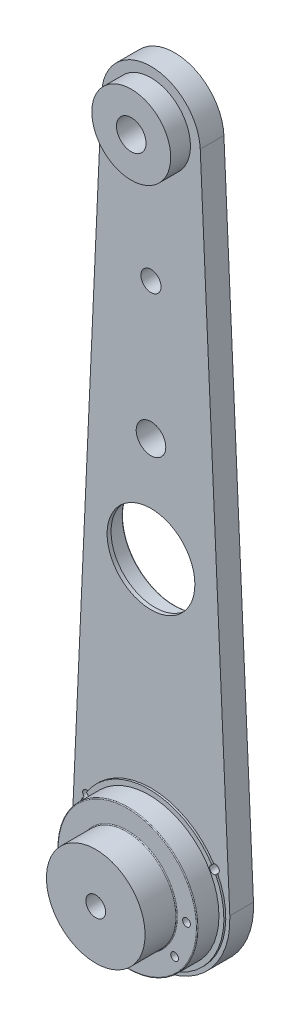
ISO-10303-21;
HEADER;
FILE_DESCRIPTION(('STEP AP214'),'2;1');
FILE_NAME('part.step','',(''),(''),'','','');
FILE_SCHEMA(('AUTOMOTIVE_DESIGN { 1 0 10303 214 1 1 1 1 }'));
ENDSEC;
DATA;
#1=APPLICATION_CONTEXT('core data for automotive mechanical design processes');
#2=APPLICATION_PROTOCOL_DEFINITION('international standard','automotive_design',2000,#1);
#3=PRODUCT_CONTEXT('',#1,'mechanical');
#4=PRODUCT('Part','Part','',(#3));
#5=PRODUCT_RELATED_PRODUCT_CATEGORY('part','',(#4));
#6=PRODUCT_DEFINITION_FORMATION('','',#4);
#7=PRODUCT_DEFINITION_CONTEXT('part definition',#1,'design');
#8=PRODUCT_DEFINITION('design','',#6,#7);
#9=PRODUCT_DEFINITION_SHAPE('','',#8);
#10=(LENGTH_UNIT() NAMED_UNIT(*) SI_UNIT(.MILLI.,.METRE.));
#11=(NAMED_UNIT(*) PLANE_ANGLE_UNIT() SI_UNIT($,.RADIAN.));
#12=(NAMED_UNIT(*) SI_UNIT($,.STERADIAN.) SOLID_ANGLE_UNIT());
#13=UNCERTAINTY_MEASURE_WITH_UNIT(LENGTH_MEASURE(1.E-05),#10,'distance_accuracy_value','');
#14=(GEOMETRIC_REPRESENTATION_CONTEXT(3) GLOBAL_UNCERTAINTY_ASSIGNED_CONTEXT((#13)) GLOBAL_UNIT_ASSIGNED_CONTEXT((#10,
#11,#12)) REPRESENTATION_CONTEXT('',''));
#15=CARTESIAN_POINT('',(0.,0.,0.));
#16=DIRECTION('',(0.,0.,1.));
#17=DIRECTION('',(1.,0.,0.));
#18=AXIS2_PLACEMENT_3D('',#15,#16,#17);
#19=CARTESIAN_POINT('',(0.,0.,21.59));
#20=DIRECTION('',(0.,0.,-1.));
#21=DIRECTION('',(0.,1.,0.));
#22=AXIS2_PLACEMENT_3D('',#19,#20,#21);
#23=CYLINDRICAL_SURFACE('',#22,3.175);
#24=CARTESIAN_POINT('',(0.,0.,21.59));
#25=DIRECTION('',(0.,0.,-1.));
#26=DIRECTION('',(0.,1.,0.));
#27=AXIS2_PLACEMENT_3D('',#24,#25,#26);
#28=CIRCLE('',#27,3.175);
#29=CARTESIAN_POINT('',(0.,3.175,21.59));
#30=VERTEX_POINT('',#29);
#31=EDGE_CURVE('E225',#30,#30,#28,.T.);
#32=ORIENTED_EDGE('',*,*,#31,.F.);
#33=EDGE_LOOP('',(#32));
#34=FACE_BOUND('',#33,.T.);
#35=CARTESIAN_POINT('',(0.,0.,6.35));
#36=DIRECTION('',(0.,0.,-1.));
#37=DIRECTION('',(0.,1.,0.));
#38=AXIS2_PLACEMENT_3D('',#35,#36,#37);
#39=CIRCLE('',#38,3.175);
#40=CARTESIAN_POINT('',(0.,3.175,6.35));
#41=VERTEX_POINT('',#40);
#42=EDGE_CURVE('E222',#41,#41,#39,.F.);
#43=ORIENTED_EDGE('',*,*,#42,.F.);
#44=EDGE_LOOP('',(#43));
#45=FACE_BOUND('',#44,.T.);
#46=ADVANCED_FACE('F39',(#34,#45),#23,.F.);
#47=CARTESIAN_POINT('',(0.,0.,79.566639504394));
#48=DIRECTION('',(0.,0.,-1.));
#49=DIRECTION('',(-1.,0.,0.));
#50=AXIS2_PLACEMENT_3D('',#47,#48,#49);
#51=CYLINDRICAL_SURFACE('',#50,24.0899399204101);
#52=CARTESIAN_POINT('',(0.,0.,3.80999999999999));
#53=DIRECTION('',(0.,0.,-1.));
#54=DIRECTION('',(-1.,0.,0.));
#55=AXIS2_PLACEMENT_3D('',#52,#53,#54);
#56=CIRCLE('',#55,24.0899399204101);
#57=CARTESIAN_POINT('',(20.2083845723923,13.1128333453631,3.80999999999999));
#58=VERTEX_POINT('',#57);
#59=CARTESIAN_POINT('',(-20.2083845723923,13.1128333453631,3.80999999999999));
#60=VERTEX_POINT('',#59);
#61=EDGE_CURVE('E200',#58,#60,#56,.F.);
#62=ORIENTED_EDGE('',*,*,#61,.T.);
#63=DIRECTION('',(0.,0.,-1.));
#64=VECTOR('',#63,1.);
#65=CARTESIAN_POINT('',(-20.2083845723923,13.1128333453631,8.889994));
#66=LINE('',#65,#64);
#67=CARTESIAN_POINT('',(-20.2083845723923,13.1128333453631,4.43));
#68=VERTEX_POINT('',#67);
#69=EDGE_CURVE('E865',#60,#68,#66,.F.);
#70=ORIENTED_EDGE('',*,*,#69,.T.);
#71=CARTESIAN_POINT('',(0.,0.,4.43));
#72=DIRECTION('',(0.,0.,1.));
#73=DIRECTION('',(1.,0.,0.));
#74=AXIS2_PLACEMENT_3D('',#71,#72,#73);
#75=CIRCLE('',#74,24.0899399204101);
#76=CARTESIAN_POINT('',(20.2083845723923,13.1128333453631,4.43));
#77=VERTEX_POINT('',#76);
#78=EDGE_CURVE('E149',#77,#68,#75,.T.);
#79=ORIENTED_EDGE('',*,*,#78,.F.);
#80=DIRECTION('',(0.,0.,-1.));
#81=VECTOR('',#80,1.);
#82=CARTESIAN_POINT('',(20.2083845723923,13.1128333453631,8.889994));
#83=LINE('',#82,#81);
#84=EDGE_CURVE('E63',#77,#58,#83,.T.);
#85=ORIENTED_EDGE('',*,*,#84,.T.);
#86=EDGE_LOOP('',(#62,#70,#79,#85));
#87=FACE_BOUND('',#86,.T.);
#88=ADVANCED_FACE('F354',(#87),#51,.T.);
#89=CARTESIAN_POINT('',(0.,209.417020078,3.81));
#90=DIRECTION('',(0.,0.,-1.));
#91=DIRECTION('',(-1.,0.,0.));
#92=AXIS2_PLACEMENT_3D('',#89,#90,#91);
#93=PLANE('',#92);
#94=CARTESIAN_POINT('',(0.,165.458510078,3.81));
#95=DIRECTION('',(0.,0.,-1.));
#96=DIRECTION('',(-1.,0.,0.));
#97=AXIS2_PLACEMENT_3D('',#94,#95,#96);
#98=CIRCLE('',#97,3.2385);
#99=CARTESIAN_POINT('',(-3.23849999999999,165.458510078,3.81));
#100=VERTEX_POINT('',#99);
#101=EDGE_CURVE('E207',#100,#100,#98,.T.);
#102=ORIENTED_EDGE('',*,*,#101,.T.);
#103=EDGE_LOOP('',(#102));
#104=FACE_BOUND('',#103,.T.);
#105=CARTESIAN_POINT('',(0.,87.91702,3.81));
#106=DIRECTION('',(0.,0.,1.));
#107=DIRECTION('',(1.,0.,0.));
#108=AXIS2_PLACEMENT_3D('',#105,#106,#107);
#109=CIRCLE('',#108,14.12875);
#110=CARTESIAN_POINT('',(14.12875,87.91702,3.81));
#111=VERTEX_POINT('',#110);
#112=EDGE_CURVE('E326',#111,#111,#109,.T.);
#113=ORIENTED_EDGE('',*,*,#112,.F.);
#114=EDGE_LOOP('',(#113));
#115=FACE_BOUND('',#114,.T.);
#116=CARTESIAN_POINT('',(0.,209.417020078,3.81));
#117=DIRECTION('',(0.,0.,1.));
#118=DIRECTION('',(-1.,0.,0.));
#119=AXIS2_PLACEMENT_3D('',#116,#117,#118);
#120=CIRCLE('',#119,15.875);
#121=CARTESIAN_POINT('',(15.858570870943,210.139069197712,3.81));
#122=VERTEX_POINT('',#121);
#123=CARTESIAN_POINT('',(-15.858570870943,210.139069197712,3.81));
#124=VERTEX_POINT('',#123);
#125=EDGE_CURVE('E163',#122,#124,#120,.T.);
#126=ORIENTED_EDGE('',*,*,#125,.T.);
#127=DIRECTION('',(-0.0454834091157075,-0.998965094232633,0.));
#128=VECTOR('',#127,1.);
#129=CARTESIAN_POINT('',(-15.858570870943,210.139069197712,3.81));
#130=LINE('',#129,#128);
#131=CARTESIAN_POINT('',(-25.3737133935089,1.15527859153897,3.81));
#132=VERTEX_POINT('',#131);
#133=EDGE_CURVE('E166',#124,#132,#130,.T.);
#134=ORIENTED_EDGE('',*,*,#133,.T.);
#135=CARTESIAN_POINT('',(0.,0.,3.81));
#136=DIRECTION('',(0.,0.,1.));
#137=DIRECTION('',(1.,0.,0.));
#138=AXIS2_PLACEMENT_3D('',#135,#136,#137);
#139=CIRCLE('',#138,25.4);
#140=CARTESIAN_POINT('',(25.3737133935089,1.15527859153897,3.81));
#141=VERTEX_POINT('',#140);
#142=EDGE_CURVE('E169',#132,#141,#139,.T.);
#143=ORIENTED_EDGE('',*,*,#142,.T.);
#144=DIRECTION('',(-0.0454834091157075,0.998965094232633,0.));
#145=VECTOR('',#144,1.);
#146=CARTESIAN_POINT('',(25.3737133935089,1.15527859153897,3.81));
#147=LINE('',#146,#145);
#148=EDGE_CURVE('E171',#141,#122,#147,.T.);
#149=ORIENTED_EDGE('',*,*,#148,.T.);
#150=EDGE_LOOP('',(#126,#134,#143,#149));
#151=FACE_BOUND('',#150,.T.);
#152=CARTESIAN_POINT('',(-21.454741785808,10.9553302220093,3.80999999999999));
#153=VERTEX_POINT('',#152);
#154=CARTESIAN_POINT('',(21.454741785808,10.9553302220094,3.80999999999999));
#155=VERTEX_POINT('',#154);
#156=EDGE_CURVE('E144',#153,#155,#56,.F.);
#157=ORIENTED_EDGE('',*,*,#156,.F.);
#158=CARTESIAN_POINT('',(-20.7430739220602,11.9829628663471,3.81));
#159=DIRECTION('',(0.,0.,-1.));
#160=DIRECTION('',(-1.,0.,0.));
#161=AXIS2_PLACEMENT_3D('',#158,#159,#160);
#162=CIRCLE('',#161,1.25);
#163=EDGE_CURVE('E275',#153,#60,#162,.T.);
#164=ORIENTED_EDGE('',*,*,#163,.T.);
#165=ORIENTED_EDGE('',*,*,#61,.F.);
#166=CARTESIAN_POINT('',(20.7430739220602,11.9829628663471,3.81));
#167=DIRECTION('',(0.,0.,-1.));
#168=DIRECTION('',(-1.,0.,0.));
#169=AXIS2_PLACEMENT_3D('',#166,#167,#168);
#170=CIRCLE('',#169,1.25);
#171=EDGE_CURVE('E145',#58,#155,#170,.T.);
#172=ORIENTED_EDGE('',*,*,#171,.T.);
#173=EDGE_LOOP('',(#157,#164,#165,#172));
#174=FACE_BOUND('',#173,.T.);
#175=CARTESIAN_POINT('',(0.,121.500000078,3.81));
#176=DIRECTION('',(0.,0.,-1.));
#177=DIRECTION('',(-1.,0.,0.));
#178=AXIS2_PLACEMENT_3D('',#175,#176,#177);
#179=CIRCLE('',#178,4.76249999999999);
#180=CARTESIAN_POINT('',(-4.76249999999999,121.500000078,3.81));
#181=VERTEX_POINT('',#180);
#182=EDGE_CURVE('E150',#181,#181,#179,.T.);
#183=ORIENTED_EDGE('',*,*,#182,.T.);
#184=EDGE_LOOP('',(#183));
#185=FACE_BOUND('',#184,.T.);
#186=CARTESIAN_POINT('',(0.,209.417020078,3.81));
#187=DIRECTION('',(0.,0.,-1.));
#188=DIRECTION('',(-1.,0.,0.));
#189=AXIS2_PLACEMENT_3D('',#186,#187,#188);
#190=CIRCLE('',#189,12.7);
#191=CARTESIAN_POINT('',(-12.7,209.417020078,3.81));
#192=VERTEX_POINT('',#191);
#193=EDGE_CURVE('E136',#192,#192,#190,.F.);
#194=ORIENTED_EDGE('',*,*,#193,.F.);
#195=EDGE_LOOP('',(#194));
#196=FACE_BOUND('',#195,.T.);
#197=ADVANCED_FACE('F351',(#104,#115,#151,#174,#185,#196),#93,.F.);
#198=CARTESIAN_POINT('',(0.,209.417020078,-3.81));
#199=DIRECTION('',(0.,0.,-1.));
#200=DIRECTION('',(-1.,0.,0.));
#201=AXIS2_PLACEMENT_3D('',#198,#199,#200);
#202=PLANE('',#201);
#203=CARTESIAN_POINT('',(0.,87.91702,-3.81));
#204=DIRECTION('',(0.,0.,-1.));
#205=DIRECTION('',(-1.,0.,0.));
#206=AXIS2_PLACEMENT_3D('',#203,#204,#205);
#207=CIRCLE('',#206,16.92275);
#208=CARTESIAN_POINT('',(-16.92275,87.91702,-3.81));
#209=VERTEX_POINT('',#208);
#210=EDGE_CURVE('E221',#209,#209,#207,.F.);
#211=ORIENTED_EDGE('',*,*,#210,.T.);
#212=EDGE_LOOP('',(#211));
#213=FACE_BOUND('',#212,.T.);
#214=CARTESIAN_POINT('',(0.,165.458510078,-3.81));
#215=DIRECTION('',(0.,0.,1.));
#216=DIRECTION('',(1.,0.,0.));
#217=AXIS2_PLACEMENT_3D('',#214,#215,#216);
#218=CIRCLE('',#217,3.2385);
#219=CARTESIAN_POINT('',(3.2385,165.458510078,-3.81));
#220=VERTEX_POINT('',#219);
#221=EDGE_CURVE('E846',#220,#220,#218,.T.);
#222=ORIENTED_EDGE('',*,*,#221,.T.);
#223=EDGE_LOOP('',(#222));
#224=FACE_BOUND('',#223,.T.);
#225=CARTESIAN_POINT('',(-20.7430739220602,11.9829628663471,-3.81));
#226=DIRECTION('',(0.,0.,-1.));
#227=DIRECTION('',(-1.,0.,0.));
#228=AXIS2_PLACEMENT_3D('',#225,#226,#227);
#229=CIRCLE('',#228,1.25);
#230=CARTESIAN_POINT('',(-21.9930739220602,11.9829628663471,-3.81));
#231=VERTEX_POINT('',#230);
#232=EDGE_CURVE('E269',#231,#231,#229,.T.);
#233=ORIENTED_EDGE('',*,*,#232,.F.);
#234=EDGE_LOOP('',(#233));
#235=FACE_BOUND('',#234,.T.);
#236=CARTESIAN_POINT('',(-19.0617897039471,0.,-3.81));
#237=DIRECTION('',(0.,0.,-1.));
#238=DIRECTION('',(-1.,0.,0.));
#239=AXIS2_PLACEMENT_3D('',#236,#237,#238);
#240=CIRCLE('',#239,1.25);
#241=CARTESIAN_POINT('',(-20.3117897039471,0.,-3.81));
#242=VERTEX_POINT('',#241);
#243=EDGE_CURVE('E218',#242,#242,#240,.T.);
#244=ORIENTED_EDGE('',*,*,#243,.F.);
#245=EDGE_LOOP('',(#244));
#246=FACE_BOUND('',#245,.T.);
#247=CARTESIAN_POINT('',(-15.2211714316762,-11.4746575968535,-3.81));
#248=DIRECTION('',(0.,0.,-1.));
#249=DIRECTION('',(-1.,0.,0.));
#250=AXIS2_PLACEMENT_3D('',#247,#248,#249);
#251=CIRCLE('',#250,1.25);
#252=CARTESIAN_POINT('',(-16.4711714316762,-11.4746575968535,-3.81));
#253=VERTEX_POINT('',#252);
#254=EDGE_CURVE('E215',#253,#253,#251,.T.);
#255=ORIENTED_EDGE('',*,*,#254,.F.);
#256=EDGE_LOOP('',(#255));
#257=FACE_BOUND('',#256,.T.);
#258=CARTESIAN_POINT('',(15.2211714316762,-11.4746575968535,-3.81));
#259=DIRECTION('',(0.,0.,-1.));
#260=DIRECTION('',(-1.,0.,0.));
#261=AXIS2_PLACEMENT_3D('',#258,#259,#260);
#262=CIRCLE('',#261,1.25);
#263=CARTESIAN_POINT('',(13.9711714316762,-11.4746575968535,-3.81));
#264=VERTEX_POINT('',#263);
#265=EDGE_CURVE('E211',#264,#264,#262,.T.);
#266=ORIENTED_EDGE('',*,*,#265,.F.);
#267=EDGE_LOOP('',(#266));
#268=FACE_BOUND('',#267,.T.);
#269=CARTESIAN_POINT('',(19.0617897039471,0.,-3.81));
#270=DIRECTION('',(0.,0.,-1.));
#271=DIRECTION('',(-1.,0.,0.));
#272=AXIS2_PLACEMENT_3D('',#269,#270,#271);
#273=CIRCLE('',#272,1.25);
#274=CARTESIAN_POINT('',(17.8117897039471,0.,-3.81));
#275=VERTEX_POINT('',#274);
#276=EDGE_CURVE('E206',#275,#275,#273,.T.);
#277=ORIENTED_EDGE('',*,*,#276,.F.);
#278=EDGE_LOOP('',(#277));
#279=FACE_BOUND('',#278,.T.);
#280=CARTESIAN_POINT('',(20.7430739220602,11.9829628663471,-3.81));
#281=DIRECTION('',(0.,0.,-1.));
#282=DIRECTION('',(-1.,0.,0.));
#283=AXIS2_PLACEMENT_3D('',#280,#281,#282);
#284=CIRCLE('',#283,1.25);
#285=CARTESIAN_POINT('',(19.4930739220602,11.9829628663471,-3.81));
#286=VERTEX_POINT('',#285);
#287=EDGE_CURVE('E861',#286,#286,#284,.T.);
#288=ORIENTED_EDGE('',*,*,#287,.F.);
#289=EDGE_LOOP('',(#288));
#290=FACE_BOUND('',#289,.T.);
#291=DIRECTION('',(0.,-1.,0.));
#292=VECTOR('',#291,1.);
#293=CARTESIAN_POINT('',(11.79375,-8.35624999999997,-3.81));
#294=LINE('',#293,#292);
#295=CARTESIAN_POINT('',(11.79375,8.35624999999997,-3.81));
#296=VERTEX_POINT('',#295);
#297=CARTESIAN_POINT('',(11.79375,-22.4959432106658,-3.80999999999999));
#298=VERTEX_POINT('',#297);
#299=EDGE_CURVE('E309',#296,#298,#294,.T.);
#300=ORIENTED_EDGE('',*,*,#299,.F.);
#301=DIRECTION('',(1.,0.,0.));
#302=VECTOR('',#301,1.);
#303=CARTESIAN_POINT('',(11.79375,8.35624999999997,-3.81));
#304=LINE('',#303,#302);
#305=CARTESIAN_POINT('',(-11.79375,8.35624999999997,-3.81));
#306=VERTEX_POINT('',#305);
#307=EDGE_CURVE('E320',#306,#296,#304,.T.);
#308=ORIENTED_EDGE('',*,*,#307,.F.);
#309=DIRECTION('',(0.,1.,0.));
#310=VECTOR('',#309,1.);
#311=CARTESIAN_POINT('',(-11.79375,-8.35624999999996,-3.81));
#312=LINE('',#311,#310);
#313=CARTESIAN_POINT('',(-11.79375,-22.4959432106658,-3.80999999999999));
#314=VERTEX_POINT('',#313);
#315=EDGE_CURVE('E303',#314,#306,#312,.T.);
#316=ORIENTED_EDGE('',*,*,#315,.F.);
#317=CARTESIAN_POINT('',(0.,0.,-3.81));
#318=DIRECTION('',(0.,0.,1.));
#319=DIRECTION('',(1.,0.,0.));
#320=AXIS2_PLACEMENT_3D('',#317,#318,#319);
#321=CIRCLE('',#320,25.4);
#322=CARTESIAN_POINT('',(-25.3737133935089,1.15527859153897,-3.81));
#323=VERTEX_POINT('',#322);
#324=EDGE_CURVE('E180',#323,#314,#321,.T.);
#325=ORIENTED_EDGE('',*,*,#324,.F.);
#326=DIRECTION('',(-0.0454834091157075,-0.998965094232633,0.));
#327=VECTOR('',#326,1.);
#328=CARTESIAN_POINT('',(-15.858570870943,210.139069197712,-3.81));
#329=LINE('',#328,#327);
#330=CARTESIAN_POINT('',(-15.858570870943,210.139069197712,-3.81));
#331=VERTEX_POINT('',#330);
#332=EDGE_CURVE('E177',#331,#323,#329,.T.);
#333=ORIENTED_EDGE('',*,*,#332,.F.);
#334=CARTESIAN_POINT('',(0.,209.417020078,-3.81));
#335=DIRECTION('',(0.,0.,1.));
#336=DIRECTION('',(-1.,0.,0.));
#337=AXIS2_PLACEMENT_3D('',#334,#335,#336);
#338=CIRCLE('',#337,15.875);
#339=CARTESIAN_POINT('',(15.858570870943,210.139069197712,-3.81));
#340=VERTEX_POINT('',#339);
#341=EDGE_CURVE('E162',#340,#331,#338,.T.);
#342=ORIENTED_EDGE('',*,*,#341,.F.);
#343=DIRECTION('',(-0.0454834091157075,0.998965094232633,0.));
#344=VECTOR('',#343,1.);
#345=CARTESIAN_POINT('',(25.3737133935089,1.15527859153897,-3.81));
#346=LINE('',#345,#344);
#347=CARTESIAN_POINT('',(25.3737133935089,1.15527859153897,-3.81));
#348=VERTEX_POINT('',#347);
#349=EDGE_CURVE('E167',#348,#340,#346,.T.);
#350=ORIENTED_EDGE('',*,*,#349,.F.);
#351=EDGE_CURVE('E179',#298,#348,#321,.T.);
#352=ORIENTED_EDGE('',*,*,#351,.F.);
#353=EDGE_LOOP('',(#300,#308,#316,#325,#333,#342,#350,#352));
#354=FACE_BOUND('',#353,.T.);
#355=CARTESIAN_POINT('',(0.,121.500000078,-3.81));
#356=DIRECTION('',(0.,0.,1.));
#357=DIRECTION('',(1.,0.,0.));
#358=AXIS2_PLACEMENT_3D('',#355,#356,#357);
#359=CIRCLE('',#358,4.76249999999999);
#360=CARTESIAN_POINT('',(4.76249999999999,121.500000078,-3.81));
#361=VERTEX_POINT('',#360);
#362=EDGE_CURVE('E155',#361,#361,#359,.T.);
#363=ORIENTED_EDGE('',*,*,#362,.T.);
#364=EDGE_LOOP('',(#363));
#365=FACE_BOUND('',#364,.T.);
#366=CARTESIAN_POINT('',(0.,209.417020078,-3.81));
#367=DIRECTION('',(0.,0.,1.));
#368=DIRECTION('',(1.,0.,0.));
#369=AXIS2_PLACEMENT_3D('',#366,#367,#368);
#370=CIRCLE('',#369,4.76249999999999);
#371=CARTESIAN_POINT('',(4.76249999999999,209.417020078,-3.81));
#372=VERTEX_POINT('',#371);
#373=EDGE_CURVE('E159',#372,#372,#370,.T.);
#374=ORIENTED_EDGE('',*,*,#373,.T.);
#375=EDGE_LOOP('',(#374));
#376=FACE_BOUND('',#375,.T.);
#377=ADVANCED_FACE('F340',(#213,#224,#235,#246,#257,#268,#279,#290,#354,#365,#376),#202,.T.);
#378=CARTESIAN_POINT('',(0.,209.417020078,3.81));
#379=DIRECTION('',(0.,0.,-1.));
#380=DIRECTION('',(-1.,0.,0.));
#381=AXIS2_PLACEMENT_3D('',#378,#379,#380);
#382=CYLINDRICAL_SURFACE('',#381,15.875);
#383=ORIENTED_EDGE('',*,*,#341,.T.);
#384=DIRECTION('',(0.,0.,-1.));
#385=VECTOR('',#384,1.);
#386=CARTESIAN_POINT('',(-15.858570870943,210.139069197712,3.81));
#387=LINE('',#386,#385);
#388=EDGE_CURVE('E193',#124,#331,#387,.T.);
#389=ORIENTED_EDGE('',*,*,#388,.F.);
#390=ORIENTED_EDGE('',*,*,#125,.F.);
#391=DIRECTION('',(0.,0.,-1.));
#392=VECTOR('',#391,1.);
#393=CARTESIAN_POINT('',(15.858570870943,210.139069197712,3.81));
#394=LINE('',#393,#392);
#395=EDGE_CURVE('E174',#122,#340,#394,.T.);
#396=ORIENTED_EDGE('',*,*,#395,.T.);
#397=EDGE_LOOP('',(#383,#389,#390,#396));
#398=FACE_BOUND('',#397,.T.);
#399=ADVANCED_FACE('F501',(#398),#382,.T.);
#400=CARTESIAN_POINT('',(-15.858570870943,210.139069197712,3.81));
#401=DIRECTION('',(0.998965094232633,-0.0454834091157075,0.));
#402=DIRECTION('',(0.0454834091157075,0.998965094232633,0.));
#403=AXIS2_PLACEMENT_3D('',#400,#401,#402);
#404=PLANE('',#403);
#405=ORIENTED_EDGE('',*,*,#332,.T.);
#406=DIRECTION('',(0.,0.,-1.));
#407=VECTOR('',#406,1.);
#408=CARTESIAN_POINT('',(-25.3737133935089,1.15527859153897,3.81));
#409=LINE('',#408,#407);
#410=EDGE_CURVE('E190',#132,#323,#409,.T.);
#411=ORIENTED_EDGE('',*,*,#410,.F.);
#412=ORIENTED_EDGE('',*,*,#133,.F.);
#413=ORIENTED_EDGE('',*,*,#388,.T.);
#414=EDGE_LOOP('',(#405,#411,#412,#413));
#415=FACE_BOUND('',#414,.T.);
#416=ADVANCED_FACE('F508',(#415),#404,.F.);
#417=CARTESIAN_POINT('',(0.,0.,3.81));
#418=DIRECTION('',(0.,0.,-1.));
#419=DIRECTION('',(-1.,0.,0.));
#420=AXIS2_PLACEMENT_3D('',#417,#418,#419);
#421=CYLINDRICAL_SURFACE('',#420,25.4);
#422=CARTESIAN_POINT('',(0.,0.,-1.27));
#423=DIRECTION('',(0.,0.,-1.));
#424=DIRECTION('',(0.,1.,0.));
#425=AXIS2_PLACEMENT_3D('',#422,#423,#424);
#426=CIRCLE('',#425,25.4);
#427=CARTESIAN_POINT('',(11.79375,-22.4959432106658,-1.26999999999999));
#428=VERTEX_POINT('',#427);
#429=CARTESIAN_POINT('',(-11.79375,-22.4959432106658,-1.26999999999999));
#430=VERTEX_POINT('',#429);
#431=EDGE_CURVE('E308',#428,#430,#426,.T.);
#432=ORIENTED_EDGE('',*,*,#431,.F.);
#433=DIRECTION('',(0.,0.,-1.));
#434=VECTOR('',#433,1.);
#435=CARTESIAN_POINT('',(11.79375,-22.4959432106658,-1.26999999999999));
#436=LINE('',#435,#434);
#437=EDGE_CURVE('E317',#428,#298,#436,.T.);
#438=ORIENTED_EDGE('',*,*,#437,.T.);
#439=ORIENTED_EDGE('',*,*,#351,.T.);
#440=DIRECTION('',(0.,0.,-1.));
#441=VECTOR('',#440,1.);
#442=CARTESIAN_POINT('',(25.3737133935089,1.15527859153897,3.81));
#443=LINE('',#442,#441);
#444=EDGE_CURVE('E187',#141,#348,#443,.T.);
#445=ORIENTED_EDGE('',*,*,#444,.F.);
#446=ORIENTED_EDGE('',*,*,#142,.F.);
#447=ORIENTED_EDGE('',*,*,#410,.T.);
#448=ORIENTED_EDGE('',*,*,#324,.T.);
#449=DIRECTION('',(0.,0.,-1.));
#450=VECTOR('',#449,1.);
#451=CARTESIAN_POINT('',(-11.79375,-22.4959432106658,-1.26999999999999));
#452=LINE('',#451,#450);
#453=EDGE_CURVE('E329',#430,#314,#452,.T.);
#454=ORIENTED_EDGE('',*,*,#453,.F.);
#455=EDGE_LOOP('',(#432,#438,#439,#445,#446,#447,#448,#454));
#456=FACE_BOUND('',#455,.T.);
#457=ADVANCED_FACE('F457',(#456),#421,.T.);
#458=CARTESIAN_POINT('',(25.3737133935089,1.15527859153897,3.81));
#459=DIRECTION('',(-0.998965094232633,-0.0454834091157075,0.));
#460=DIRECTION('',(0.0454834091157075,-0.998965094232633,0.));
#461=AXIS2_PLACEMENT_3D('',#458,#459,#460);
#462=PLANE('',#461);
#463=ORIENTED_EDGE('',*,*,#349,.T.);
#464=ORIENTED_EDGE('',*,*,#395,.F.);
#465=ORIENTED_EDGE('',*,*,#148,.F.);
#466=ORIENTED_EDGE('',*,*,#444,.T.);
#467=EDGE_LOOP('',(#463,#464,#465,#466));
#468=FACE_BOUND('',#467,.T.);
#469=ADVANCED_FACE('F496',(#468),#462,.F.);
#470=CARTESIAN_POINT('',(0.,209.417020078,3.81));
#471=DIRECTION('',(0.,0.,-1.));
#472=DIRECTION('',(-1.,0.,0.));
#473=AXIS2_PLACEMENT_3D('',#470,#471,#472);
#474=CYLINDRICAL_SURFACE('',#473,4.76249999999999);
#475=ORIENTED_EDGE('',*,*,#373,.F.);
#476=EDGE_LOOP('',(#475));
#477=FACE_BOUND('',#476,.T.);
#478=CARTESIAN_POINT('',(0.,209.417020078,10.16));
#479=DIRECTION('',(0.,0.,1.));
#480=DIRECTION('',(1.,0.,0.));
#481=AXIS2_PLACEMENT_3D('',#478,#479,#480);
#482=CIRCLE('',#481,4.76249999999999);
#483=CARTESIAN_POINT('',(4.76249999999999,209.417020078,10.16));
#484=VERTEX_POINT('',#483);
#485=EDGE_CURVE('E268',#484,#484,#482,.T.);
#486=ORIENTED_EDGE('',*,*,#485,.T.);
#487=EDGE_LOOP('',(#486));
#488=FACE_BOUND('',#487,.T.);
#489=ADVANCED_FACE('F487',(#477,#488),#474,.F.);
#490=CARTESIAN_POINT('',(-21.454741785808,10.9553302220093,4.43));
#491=VERTEX_POINT('',#490);
#492=CARTESIAN_POINT('',(21.454741785808,10.9553302220093,4.43));
#493=VERTEX_POINT('',#492);
#494=EDGE_CURVE('E142',#491,#493,#75,.T.);
#495=ORIENTED_EDGE('',*,*,#494,.F.);
#496=DIRECTION('',(0.,0.,-1.));
#497=VECTOR('',#496,1.);
#498=CARTESIAN_POINT('',(-21.454741785808,10.9553302220093,8.889994));
#499=LINE('',#498,#497);
#500=EDGE_CURVE('E55',#491,#153,#499,.T.);
#501=ORIENTED_EDGE('',*,*,#500,.T.);
#502=ORIENTED_EDGE('',*,*,#156,.T.);
#503=DIRECTION('',(0.,0.,-1.));
#504=VECTOR('',#503,1.);
#505=CARTESIAN_POINT('',(21.454741785808,10.9553302220094,8.889994));
#506=LINE('',#505,#504);
#507=EDGE_CURVE('E129',#155,#493,#506,.F.);
#508=ORIENTED_EDGE('',*,*,#507,.T.);
#509=EDGE_LOOP('',(#495,#501,#502,#508));
#510=FACE_BOUND('',#509,.T.);
#511=ADVANCED_FACE('F141',(#510),#51,.T.);
#512=CARTESIAN_POINT('',(0.,0.,4.43));
#513=DIRECTION('',(0.,0.,1.));
#514=DIRECTION('',(1.,0.,0.));
#515=AXIS2_PLACEMENT_3D('',#512,#513,#514);
#516=PLANE('',#515);
#517=CARTESIAN_POINT('',(-20.7430739220602,11.9829628663471,4.43));
#518=DIRECTION('',(0.,0.,1.));
#519=DIRECTION('',(1.,0.,0.));
#520=AXIS2_PLACEMENT_3D('',#517,#518,#519);
#521=CIRCLE('',#520,1.25);
#522=EDGE_CURVE('E135',#491,#68,#521,.T.);
#523=ORIENTED_EDGE('',*,*,#522,.F.);
#524=ORIENTED_EDGE('',*,*,#494,.T.);
#525=CARTESIAN_POINT('',(20.7430739220602,11.9829628663471,4.43));
#526=DIRECTION('',(0.,0.,1.));
#527=DIRECTION('',(1.,0.,0.));
#528=AXIS2_PLACEMENT_3D('',#525,#526,#527);
#529=CIRCLE('',#528,1.25);
#530=EDGE_CURVE('E126',#77,#493,#529,.T.);
#531=ORIENTED_EDGE('',*,*,#530,.F.);
#532=ORIENTED_EDGE('',*,*,#78,.T.);
#533=EDGE_LOOP('',(#523,#524,#531,#532));
#534=FACE_BOUND('',#533,.T.);
#535=CARTESIAN_POINT('',(0.,0.,4.43));
#536=DIRECTION('',(0.,0.,1.));
#537=DIRECTION('',(1.,0.,0.));
#538=AXIS2_PLACEMENT_3D('',#535,#536,#537);
#539=CIRCLE('',#538,22.5);
#540=CARTESIAN_POINT('',(22.5,0.,4.43));
#541=VERTEX_POINT('',#540);
#542=EDGE_CURVE('E153',#541,#541,#539,.T.);
#543=ORIENTED_EDGE('',*,*,#542,.F.);
#544=EDGE_LOOP('',(#543));
#545=FACE_BOUND('',#544,.T.);
#546=ADVANCED_FACE('F147',(#534,#545),#516,.T.);
#547=CARTESIAN_POINT('',(0.,0.,11.43));
#548=DIRECTION('',(0.,0.,1.));
#549=DIRECTION('',(1.,0.,0.));
#550=AXIS2_PLACEMENT_3D('',#547,#548,#549);
#551=PLANE('',#550);
#552=CARTESIAN_POINT('',(0.,0.,11.43));
#553=DIRECTION('',(0.,0.,1.));
#554=DIRECTION('',(1.,0.,0.));
#555=AXIS2_PLACEMENT_3D('',#552,#553,#554);
#556=CIRCLE('',#555,16.129);
#557=CARTESIAN_POINT('',(16.129,0.,11.43));
#558=VERTEX_POINT('',#557);
#559=EDGE_CURVE('E48',#558,#558,#556,.F.);
#560=ORIENTED_EDGE('',*,*,#559,.T.);
#561=EDGE_LOOP('',(#560));
#562=FACE_BOUND('',#561,.T.);
#563=CARTESIAN_POINT('',(0.,0.,11.43));
#564=DIRECTION('',(0.,0.,1.));
#565=DIRECTION('',(1.,0.,0.));
#566=AXIS2_PLACEMENT_3D('',#563,#564,#565);
#567=CIRCLE('',#566,22.246);
#568=CARTESIAN_POINT('',(22.246,0.,11.43));
#569=VERTEX_POINT('',#568);
#570=EDGE_CURVE('E242',#569,#569,#567,.T.);
#571=ORIENTED_EDGE('',*,*,#570,.T.);
#572=EDGE_LOOP('',(#571));
#573=FACE_BOUND('',#572,.T.);
#574=CARTESIAN_POINT('',(-19.0617897039471,0.,11.43));
#575=DIRECTION('',(0.,0.,1.));
#576=DIRECTION('',(1.,0.,0.));
#577=AXIS2_PLACEMENT_3D('',#574,#575,#576);
#578=CIRCLE('',#577,1.25);
#579=CARTESIAN_POINT('',(-17.8117897039471,0.,11.43));
#580=VERTEX_POINT('',#579);
#581=EDGE_CURVE('E216',#580,#580,#578,.T.);
#582=ORIENTED_EDGE('',*,*,#581,.F.);
#583=EDGE_LOOP('',(#582));
#584=FACE_BOUND('',#583,.T.);
#585=CARTESIAN_POINT('',(-15.2211714316762,-11.4746575968535,11.43));
#586=DIRECTION('',(0.,0.,1.));
#587=DIRECTION('',(1.,0.,0.));
#588=AXIS2_PLACEMENT_3D('',#585,#586,#587);
#589=CIRCLE('',#588,1.25);
#590=CARTESIAN_POINT('',(-13.9711714316762,-11.4746575968535,11.43));
#591=VERTEX_POINT('',#590);
#592=EDGE_CURVE('E212',#591,#591,#589,.T.);
#593=ORIENTED_EDGE('',*,*,#592,.F.);
#594=EDGE_LOOP('',(#593));
#595=FACE_BOUND('',#594,.T.);
#596=CARTESIAN_POINT('',(15.2211714316762,-11.4746575968535,11.43));
#597=DIRECTION('',(0.,0.,1.));
#598=DIRECTION('',(1.,0.,0.));
#599=AXIS2_PLACEMENT_3D('',#596,#597,#598);
#600=CIRCLE('',#599,1.25);
#601=CARTESIAN_POINT('',(16.4711714316762,-11.4746575968535,11.43));
#602=VERTEX_POINT('',#601);
#603=EDGE_CURVE('E208',#602,#602,#600,.T.);
#604=ORIENTED_EDGE('',*,*,#603,.F.);
#605=EDGE_LOOP('',(#604));
#606=FACE_BOUND('',#605,.T.);
#607=CARTESIAN_POINT('',(19.0617897039471,0.,11.43));
#608=DIRECTION('',(0.,0.,1.));
#609=DIRECTION('',(1.,0.,0.));
#610=AXIS2_PLACEMENT_3D('',#607,#608,#609);
#611=CIRCLE('',#610,1.25);
#612=CARTESIAN_POINT('',(20.3117897039471,0.,11.43));
#613=VERTEX_POINT('',#612);
#614=EDGE_CURVE('E203',#613,#613,#611,.T.);
#615=ORIENTED_EDGE('',*,*,#614,.F.);
#616=EDGE_LOOP('',(#615));
#617=FACE_BOUND('',#616,.T.);
#618=ADVANCED_FACE('F249',(#562,#573,#584,#595,#606,#617),#551,.T.);
#619=CARTESIAN_POINT('',(0.,0.,11.43));
#620=DIRECTION('',(0.,0.,-1.));
#621=DIRECTION('',(-1.,0.,0.));
#622=AXIS2_PLACEMENT_3D('',#619,#620,#621);
#623=CYLINDRICAL_SURFACE('',#622,22.5);
#624=CARTESIAN_POINT('',(0.,0.,11.176));
#625=DIRECTION('',(0.,0.,1.));
#626=DIRECTION('',(1.,0.,0.));
#627=AXIS2_PLACEMENT_3D('',#624,#625,#626);
#628=CIRCLE('',#627,22.5);
#629=CARTESIAN_POINT('',(22.5,0.,11.176));
#630=VERTEX_POINT('',#629);
#631=EDGE_CURVE('E12',#630,#630,#628,.F.);
#632=ORIENTED_EDGE('',*,*,#631,.T.);
#633=EDGE_LOOP('',(#632));
#634=FACE_BOUND('',#633,.T.);
#635=ORIENTED_EDGE('',*,*,#542,.T.);
#636=EDGE_LOOP('',(#635));
#637=FACE_BOUND('',#636,.T.);
#638=ADVANCED_FACE('F347',(#634,#637),#623,.T.);
#639=CARTESIAN_POINT('',(0.,121.500000078,-3.81));
#640=DIRECTION('',(0.,0.,1.));
#641=DIRECTION('',(1.,0.,0.));
#642=AXIS2_PLACEMENT_3D('',#639,#640,#641);
#643=CYLINDRICAL_SURFACE('',#642,4.76249999999999);
#644=ORIENTED_EDGE('',*,*,#362,.F.);
#645=EDGE_LOOP('',(#644));
#646=FACE_BOUND('',#645,.T.);
#647=ORIENTED_EDGE('',*,*,#182,.F.);
#648=EDGE_LOOP('',(#647));
#649=FACE_BOUND('',#648,.T.);
#650=ADVANCED_FACE('F343',(#646,#649),#643,.F.);
#651=CARTESIAN_POINT('',(0.,87.91702,-3.81));
#652=DIRECTION('',(0.,0.,1.));
#653=DIRECTION('',(1.,0.,0.));
#654=AXIS2_PLACEMENT_3D('',#651,#652,#653);
#655=CYLINDRICAL_SURFACE('',#654,16.66875);
#656=CARTESIAN_POINT('',(0.,87.91702,-3.556));
#657=DIRECTION('',(0.,0.,-1.));
#658=DIRECTION('',(-1.,0.,0.));
#659=AXIS2_PLACEMENT_3D('',#656,#657,#658);
#660=CIRCLE('',#659,16.66875);
#661=CARTESIAN_POINT('',(-16.66875,87.91702,-3.556));
#662=VERTEX_POINT('',#661);
#663=EDGE_CURVE('E232',#662,#662,#660,.T.);
#664=ORIENTED_EDGE('',*,*,#663,.T.);
#665=EDGE_LOOP('',(#664));
#666=FACE_BOUND('',#665,.T.);
#667=CARTESIAN_POINT('',(0.,87.91702,2.286));
#668=DIRECTION('',(0.,0.,-1.));
#669=DIRECTION('',(-1.,0.,0.));
#670=AXIS2_PLACEMENT_3D('',#667,#668,#669);
#671=CIRCLE('',#670,16.66875);
#672=CARTESIAN_POINT('',(-16.66875,87.91702,2.286));
#673=VERTEX_POINT('',#672);
#674=EDGE_CURVE('E229',#673,#673,#671,.F.);
#675=ORIENTED_EDGE('',*,*,#674,.T.);
#676=EDGE_LOOP('',(#675));
#677=FACE_BOUND('',#676,.T.);
#678=ADVANCED_FACE('F346',(#666,#677),#655,.F.);
#679=CARTESIAN_POINT('',(0.,87.91702,-50.9563446356131));
#680=DIRECTION('',(0.,0.,1.));
#681=DIRECTION('',(1.,0.,0.));
#682=AXIS2_PLACEMENT_3D('',#679,#680,#681);
#683=CYLINDRICAL_SURFACE('',#682,14.12875);
#684=ORIENTED_EDGE('',*,*,#112,.T.);
#685=EDGE_LOOP('',(#684));
#686=FACE_BOUND('',#685,.T.);
#687=CARTESIAN_POINT('',(0.,87.91702,2.54));
#688=DIRECTION('',(0.,0.,-1.));
#689=DIRECTION('',(-1.,0.,0.));
#690=AXIS2_PLACEMENT_3D('',#687,#688,#689);
#691=CIRCLE('',#690,14.12875);
#692=CARTESIAN_POINT('',(-14.12875,87.91702,2.54));
#693=VERTEX_POINT('',#692);
#694=EDGE_CURVE('E335',#693,#693,#691,.F.);
#695=ORIENTED_EDGE('',*,*,#694,.F.);
#696=EDGE_LOOP('',(#695));
#697=FACE_BOUND('',#696,.T.);
#698=ADVANCED_FACE('F476',(#686,#697),#683,.F.);
#699=CARTESIAN_POINT('',(0.,209.417020078,2.54));
#700=DIRECTION('',(0.,0.,-1.));
#701=DIRECTION('',(-1.,0.,0.));
#702=AXIS2_PLACEMENT_3D('',#699,#700,#701);
#703=PLANE('',#702);
#704=CARTESIAN_POINT('',(0.,87.91702,2.54));
#705=DIRECTION('',(0.,0.,-1.));
#706=DIRECTION('',(-1.,0.,0.));
#707=AXIS2_PLACEMENT_3D('',#704,#705,#706);
#708=CIRCLE('',#707,16.41475);
#709=CARTESIAN_POINT('',(-16.41475,87.91702,2.54));
#710=VERTEX_POINT('',#709);
#711=EDGE_CURVE('E235',#710,#710,#708,.T.);
#712=ORIENTED_EDGE('',*,*,#711,.T.);
#713=EDGE_LOOP('',(#712));
#714=FACE_BOUND('',#713,.T.);
#715=ORIENTED_EDGE('',*,*,#694,.T.);
#716=EDGE_LOOP('',(#715));
#717=FACE_BOUND('',#716,.T.);
#718=ADVANCED_FACE('F473',(#714,#717),#703,.T.);
#719=CARTESIAN_POINT('',(11.79375,-8.35624999999997,-1.27));
#720=DIRECTION('',(1.,0.,0.));
#721=DIRECTION('',(0.,1.,0.));
#722=AXIS2_PLACEMENT_3D('',#719,#720,#721);
#723=PLANE('',#722);
#724=ORIENTED_EDGE('',*,*,#299,.T.);
#725=ORIENTED_EDGE('',*,*,#437,.F.);
#726=DIRECTION('',(0.,-1.,0.));
#727=VECTOR('',#726,1.);
#728=CARTESIAN_POINT('',(11.79375,-8.35624999999997,-1.27));
#729=LINE('',#728,#727);
#730=CARTESIAN_POINT('',(11.79375,8.35624999999997,-1.27));
#731=VERTEX_POINT('',#730);
#732=EDGE_CURVE('E306',#731,#428,#729,.T.);
#733=ORIENTED_EDGE('',*,*,#732,.F.);
#734=DIRECTION('',(0.,0.,-1.));
#735=VECTOR('',#734,1.);
#736=CARTESIAN_POINT('',(11.79375,8.35624999999997,-1.27));
#737=LINE('',#736,#735);
#738=EDGE_CURVE('E324',#731,#296,#737,.T.);
#739=ORIENTED_EDGE('',*,*,#738,.T.);
#740=EDGE_LOOP('',(#724,#725,#733,#739));
#741=FACE_BOUND('',#740,.T.);
#742=ADVANCED_FACE('F453',(#741),#723,.F.);
#743=CARTESIAN_POINT('',(11.79375,8.35624999999997,-1.27));
#744=DIRECTION('',(0.,1.,0.));
#745=DIRECTION('',(0.,0.,1.));
#746=AXIS2_PLACEMENT_3D('',#743,#744,#745);
#747=PLANE('',#746);
#748=ORIENTED_EDGE('',*,*,#307,.T.);
#749=ORIENTED_EDGE('',*,*,#738,.F.);
#750=DIRECTION('',(1.,0.,0.));
#751=VECTOR('',#750,1.);
#752=CARTESIAN_POINT('',(11.79375,8.35624999999997,-1.27));
#753=LINE('',#752,#751);
#754=CARTESIAN_POINT('',(-11.79375,8.35624999999997,-1.27));
#755=VERTEX_POINT('',#754);
#756=EDGE_CURVE('E314',#755,#731,#753,.T.);
#757=ORIENTED_EDGE('',*,*,#756,.F.);
#758=DIRECTION('',(0.,0.,-1.));
#759=VECTOR('',#758,1.);
#760=CARTESIAN_POINT('',(-11.79375,8.35624999999997,-1.27));
#761=LINE('',#760,#759);
#762=EDGE_CURVE('E327',#755,#306,#761,.T.);
#763=ORIENTED_EDGE('',*,*,#762,.T.);
#764=EDGE_LOOP('',(#748,#749,#757,#763));
#765=FACE_BOUND('',#764,.T.);
#766=ADVANCED_FACE('F465',(#765),#747,.F.);
#767=CARTESIAN_POINT('',(-11.79375,-8.35624999999996,-1.27));
#768=DIRECTION('',(-1.,0.,0.));
#769=DIRECTION('',(0.,-1.,0.));
#770=AXIS2_PLACEMENT_3D('',#767,#768,#769);
#771=PLANE('',#770);
#772=ORIENTED_EDGE('',*,*,#315,.T.);
#773=ORIENTED_EDGE('',*,*,#762,.F.);
#774=DIRECTION('',(0.,1.,0.));
#775=VECTOR('',#774,1.);
#776=CARTESIAN_POINT('',(-11.79375,-22.4959432106658,-1.26999999999999));
#777=LINE('',#776,#775);
#778=EDGE_CURVE('E312',#430,#755,#777,.T.);
#779=ORIENTED_EDGE('',*,*,#778,.F.);
#780=ORIENTED_EDGE('',*,*,#453,.T.);
#781=EDGE_LOOP('',(#772,#773,#779,#780));
#782=FACE_BOUND('',#781,.T.);
#783=ADVANCED_FACE('F444',(#782),#771,.F.);
#784=CARTESIAN_POINT('',(0.,0.,-1.27));
#785=DIRECTION('',(0.,0.,-1.));
#786=DIRECTION('',(0.,1.,0.));
#787=AXIS2_PLACEMENT_3D('',#784,#785,#786);
#788=PLANE('',#787);
#789=CARTESIAN_POINT('',(0.,0.,-1.27));
#790=DIRECTION('',(0.,0.,-1.));
#791=DIRECTION('',(0.,1.,0.));
#792=AXIS2_PLACEMENT_3D('',#789,#790,#791);
#793=CIRCLE('',#792,6.35);
#794=CARTESIAN_POINT('',(0.,6.35,-1.27));
#795=VERTEX_POINT('',#794);
#796=EDGE_CURVE('E839',#795,#795,#793,.T.);
#797=ORIENTED_EDGE('',*,*,#796,.F.);
#798=EDGE_LOOP('',(#797));
#799=FACE_BOUND('',#798,.T.);
#800=CARTESIAN_POINT('',(-9.00000000000002,5.56249999999997,-1.27));
#801=DIRECTION('',(0.,0.,-1.));
#802=DIRECTION('',(0.,1.,0.));
#803=AXIS2_PLACEMENT_3D('',#800,#801,#802);
#804=CIRCLE('',#803,0.949999999999999);
#805=CARTESIAN_POINT('',(-9.00000000000002,6.51249999999997,-1.27));
#806=VERTEX_POINT('',#805);
#807=EDGE_CURVE('E281',#806,#806,#804,.T.);
#808=ORIENTED_EDGE('',*,*,#807,.F.);
#809=EDGE_LOOP('',(#808));
#810=FACE_BOUND('',#809,.T.);
#811=CARTESIAN_POINT('',(8.99999999999997,5.56250000000003,-1.27));
#812=DIRECTION('',(0.,0.,-1.));
#813=DIRECTION('',(0.,1.,0.));
#814=AXIS2_PLACEMENT_3D('',#811,#812,#813);
#815=CIRCLE('',#814,0.949999999999999);
#816=CARTESIAN_POINT('',(8.99999999999997,6.51250000000003,-1.27));
#817=VERTEX_POINT('',#816);
#818=EDGE_CURVE('E292',#817,#817,#815,.T.);
#819=ORIENTED_EDGE('',*,*,#818,.F.);
#820=EDGE_LOOP('',(#819));
#821=FACE_BOUND('',#820,.T.);
#822=CARTESIAN_POINT('',(9.00000000000001,-5.56249999999997,-1.27));
#823=DIRECTION('',(0.,0.,-1.));
#824=DIRECTION('',(0.,1.,0.));
#825=AXIS2_PLACEMENT_3D('',#822,#823,#824);
#826=CIRCLE('',#825,0.949999999999999);
#827=CARTESIAN_POINT('',(9.00000000000001,-4.61249999999997,-1.27));
#828=VERTEX_POINT('',#827);
#829=EDGE_CURVE('E286',#828,#828,#826,.T.);
#830=ORIENTED_EDGE('',*,*,#829,.F.);
#831=EDGE_LOOP('',(#830));
#832=FACE_BOUND('',#831,.T.);
#833=CARTESIAN_POINT('',(-8.99999999999999,-5.56250000000003,-1.27));
#834=DIRECTION('',(0.,0.,-1.));
#835=DIRECTION('',(0.,1.,0.));
#836=AXIS2_PLACEMENT_3D('',#833,#834,#835);
#837=CIRCLE('',#836,0.949999999999999);
#838=CARTESIAN_POINT('',(-8.99999999999999,-4.61250000000003,-1.27));
#839=VERTEX_POINT('',#838);
#840=EDGE_CURVE('E285',#839,#839,#837,.T.);
#841=ORIENTED_EDGE('',*,*,#840,.F.);
#842=EDGE_LOOP('',(#841));
#843=FACE_BOUND('',#842,.T.);
#844=ORIENTED_EDGE('',*,*,#732,.T.);
#845=ORIENTED_EDGE('',*,*,#431,.T.);
#846=ORIENTED_EDGE('',*,*,#778,.T.);
#847=ORIENTED_EDGE('',*,*,#756,.T.);
#848=EDGE_LOOP('',(#844,#845,#846,#847));
#849=FACE_BOUND('',#848,.T.);
#850=ADVANCED_FACE('F438',(#799,#810,#821,#832,#843,#849),#788,.T.);
#851=CARTESIAN_POINT('',(-8.99999999999999,-5.56250000000003,11.4300000000001));
#852=DIRECTION('',(0.,0.,-1.));
#853=DIRECTION('',(0.,1.,0.));
#854=AXIS2_PLACEMENT_3D('',#851,#852,#853);
#855=CYLINDRICAL_SURFACE('',#854,0.949999999999999);
#856=CARTESIAN_POINT('',(-8.99999999999999,-5.56250000000003,11.4300000000001));
#857=DIRECTION('',(0.,0.,-1.));
#858=DIRECTION('',(0.,1.,0.));
#859=AXIS2_PLACEMENT_3D('',#856,#857,#858);
#860=CIRCLE('',#859,0.949999999999999);
#861=CARTESIAN_POINT('',(-8.99999999999999,-4.61250000000003,11.4300000000001));
#862=VERTEX_POINT('',#861);
#863=EDGE_CURVE('E300',#862,#862,#860,.T.);
#864=ORIENTED_EDGE('',*,*,#863,.F.);
#865=EDGE_LOOP('',(#864));
#866=FACE_BOUND('',#865,.T.);
#867=ORIENTED_EDGE('',*,*,#840,.T.);
#868=EDGE_LOOP('',(#867));
#869=FACE_BOUND('',#868,.T.);
#870=ADVANCED_FACE('F434',(#866,#869),#855,.F.);
#871=CARTESIAN_POINT('',(9.00000000000001,-5.56249999999996,11.4300000000001));
#872=DIRECTION('',(0.,0.,-1.));
#873=DIRECTION('',(0.,1.,0.));
#874=AXIS2_PLACEMENT_3D('',#871,#872,#873);
#875=CYLINDRICAL_SURFACE('',#874,0.949999999999999);
#876=CARTESIAN_POINT('',(9.00000000000001,-5.56249999999996,11.4300000000001));
#877=DIRECTION('',(0.,0.,-1.));
#878=DIRECTION('',(0.,1.,0.));
#879=AXIS2_PLACEMENT_3D('',#876,#877,#878);
#880=CIRCLE('',#879,0.949999999999999);
#881=CARTESIAN_POINT('',(9.00000000000001,-4.61249999999996,11.4300000000001));
#882=VERTEX_POINT('',#881);
#883=EDGE_CURVE('E282',#882,#882,#880,.T.);
#884=ORIENTED_EDGE('',*,*,#883,.F.);
#885=EDGE_LOOP('',(#884));
#886=FACE_BOUND('',#885,.T.);
#887=ORIENTED_EDGE('',*,*,#829,.T.);
#888=EDGE_LOOP('',(#887));
#889=FACE_BOUND('',#888,.T.);
#890=ADVANCED_FACE('F437',(#886,#889),#875,.F.);
#891=CARTESIAN_POINT('',(8.99999999999997,5.56250000000004,11.43));
#892=DIRECTION('',(0.,0.,-1.));
#893=DIRECTION('',(0.,1.,0.));
#894=AXIS2_PLACEMENT_3D('',#891,#892,#893);
#895=CYLINDRICAL_SURFACE('',#894,0.949999999999999);
#896=CARTESIAN_POINT('',(8.99999999999997,5.56250000000004,11.43));
#897=DIRECTION('',(0.,0.,-1.));
#898=DIRECTION('',(0.,1.,0.));
#899=AXIS2_PLACEMENT_3D('',#896,#897,#898);
#900=CIRCLE('',#899,0.949999999999999);
#901=CARTESIAN_POINT('',(8.99999999999997,6.51250000000004,11.43));
#902=VERTEX_POINT('',#901);
#903=EDGE_CURVE('E289',#902,#902,#900,.T.);
#904=ORIENTED_EDGE('',*,*,#903,.F.);
#905=EDGE_LOOP('',(#904));
#906=FACE_BOUND('',#905,.T.);
#907=ORIENTED_EDGE('',*,*,#818,.T.);
#908=EDGE_LOOP('',(#907));
#909=FACE_BOUND('',#908,.T.);
#910=ADVANCED_FACE('F754',(#906,#909),#895,.F.);
#911=CARTESIAN_POINT('',(-9.00000000000002,5.56249999999997,11.43));
#912=DIRECTION('',(0.,0.,-1.));
#913=DIRECTION('',(0.,1.,0.));
#914=AXIS2_PLACEMENT_3D('',#911,#912,#913);
#915=CYLINDRICAL_SURFACE('',#914,0.949999999999999);
#916=CARTESIAN_POINT('',(-9.00000000000002,5.56249999999997,11.43));
#917=DIRECTION('',(0.,0.,-1.));
#918=DIRECTION('',(0.,1.,0.));
#919=AXIS2_PLACEMENT_3D('',#916,#917,#918);
#920=CIRCLE('',#919,0.949999999999999);
#921=CARTESIAN_POINT('',(-9.00000000000002,6.51249999999997,11.43));
#922=VERTEX_POINT('',#921);
#923=EDGE_CURVE('E295',#922,#922,#920,.T.);
#924=ORIENTED_EDGE('',*,*,#923,.F.);
#925=EDGE_LOOP('',(#924));
#926=FACE_BOUND('',#925,.T.);
#927=ORIENTED_EDGE('',*,*,#807,.T.);
#928=EDGE_LOOP('',(#927));
#929=FACE_BOUND('',#928,.T.);
#930=ADVANCED_FACE('F370',(#926,#929),#915,.F.);
#931=CARTESIAN_POINT('',(0.,209.417020078,10.16));
#932=DIRECTION('',(0.,0.,1.));
#933=DIRECTION('',(1.,0.,0.));
#934=AXIS2_PLACEMENT_3D('',#931,#932,#933);
#935=PLANE('',#934);
#936=CARTESIAN_POINT('',(0.,209.417020078,10.16));
#937=DIRECTION('',(0.,0.,1.));
#938=DIRECTION('',(1.,0.,0.));
#939=AXIS2_PLACEMENT_3D('',#936,#937,#938);
#940=CIRCLE('',#939,12.7);
#941=CARTESIAN_POINT('',(12.7,209.417020078,10.16));
#942=VERTEX_POINT('',#941);
#943=EDGE_CURVE('E272',#942,#942,#940,.T.);
#944=ORIENTED_EDGE('',*,*,#943,.T.);
#945=EDGE_LOOP('',(#944));
#946=FACE_BOUND('',#945,.T.);
#947=ORIENTED_EDGE('',*,*,#485,.F.);
#948=EDGE_LOOP('',(#947));
#949=FACE_BOUND('',#948,.T.);
#950=ADVANCED_FACE('F361',(#946,#949),#935,.T.);
#951=CARTESIAN_POINT('',(0.,209.417020078,10.16));
#952=DIRECTION('',(0.,0.,-1.));
#953=DIRECTION('',(-1.,0.,0.));
#954=AXIS2_PLACEMENT_3D('',#951,#952,#953);
#955=CYLINDRICAL_SURFACE('',#954,12.7);
#956=ORIENTED_EDGE('',*,*,#943,.F.);
#957=EDGE_LOOP('',(#956));
#958=FACE_BOUND('',#957,.T.);
#959=ORIENTED_EDGE('',*,*,#193,.T.);
#960=EDGE_LOOP('',(#959));
#961=FACE_BOUND('',#960,.T.);
#962=ADVANCED_FACE('F359',(#958,#961),#955,.T.);
#963=CARTESIAN_POINT('',(0.,0.,21.59));
#964=DIRECTION('',(0.,0.,1.));
#965=DIRECTION('',(1.,0.,0.));
#966=AXIS2_PLACEMENT_3D('',#963,#964,#965);
#967=PLANE('',#966);
#968=ORIENTED_EDGE('',*,*,#31,.T.);
#969=EDGE_LOOP('',(#968));
#970=FACE_BOUND('',#969,.T.);
#971=CARTESIAN_POINT('',(0.,0.,21.59));
#972=DIRECTION('',(0.,0.,1.));
#973=DIRECTION('',(1.,0.,0.));
#974=AXIS2_PLACEMENT_3D('',#971,#972,#973);
#975=CIRCLE('',#974,15.875);
#976=CARTESIAN_POINT('',(15.875,0.,21.59));
#977=VERTEX_POINT('',#976);
#978=EDGE_CURVE('E266',#977,#977,#975,.T.);
#979=ORIENTED_EDGE('',*,*,#978,.T.);
#980=EDGE_LOOP('',(#979));
#981=FACE_BOUND('',#980,.T.);
#982=ADVANCED_FACE('F262',(#970,#981),#967,.T.);
#983=CARTESIAN_POINT('',(0.,0.,21.59));
#984=DIRECTION('',(0.,0.,-1.));
#985=DIRECTION('',(-1.,0.,0.));
#986=AXIS2_PLACEMENT_3D('',#983,#984,#985);
#987=CYLINDRICAL_SURFACE('',#986,15.875);
#988=CARTESIAN_POINT('',(0.,0.,11.684));
#989=DIRECTION('',(0.,0.,1.));
#990=DIRECTION('',(1.,0.,0.));
#991=AXIS2_PLACEMENT_3D('',#988,#989,#990);
#992=CIRCLE('',#991,15.875);
#993=CARTESIAN_POINT('',(15.875,0.,11.684));
#994=VERTEX_POINT('',#993);
#995=EDGE_CURVE('E238',#994,#994,#992,.T.);
#996=ORIENTED_EDGE('',*,*,#995,.T.);
#997=EDGE_LOOP('',(#996));
#998=FACE_BOUND('',#997,.T.);
#999=ORIENTED_EDGE('',*,*,#978,.F.);
#1000=EDGE_LOOP('',(#999));
#1001=FACE_BOUND('',#1000,.T.);
#1002=ADVANCED_FACE('F258',(#998,#1001),#987,.T.);
#1003=CARTESIAN_POINT('',(0.,0.,11.43));
#1004=DIRECTION('',(0.,0.,1.));
#1005=DIRECTION('',(1.,0.,0.));
#1006=AXIS2_PLACEMENT_3D('',#1003,#1004,#1005);
#1007=PLANE('',#1006);
#1008=ORIENTED_EDGE('',*,*,#863,.T.);
#1009=EDGE_LOOP('',(#1008));
#1010=FACE_BOUND('',#1009,.T.);
#1011=ADVANCED_FACE('F261',(#1010),#1007,.F.);
#1012=ORIENTED_EDGE('',*,*,#883,.T.);
#1013=EDGE_LOOP('',(#1012));
#1014=FACE_BOUND('',#1013,.T.);
#1015=ADVANCED_FACE('F424',(#1014),#1007,.F.);
#1016=ORIENTED_EDGE('',*,*,#903,.T.);
#1017=EDGE_LOOP('',(#1016));
#1018=FACE_BOUND('',#1017,.T.);
#1019=ADVANCED_FACE('F419',(#1018),#1007,.F.);
#1020=ORIENTED_EDGE('',*,*,#923,.T.);
#1021=EDGE_LOOP('',(#1020));
#1022=FACE_BOUND('',#1021,.T.);
#1023=ADVANCED_FACE('F399',(#1022),#1007,.F.);
#1024=CARTESIAN_POINT('',(19.0617897039471,0.,21.59));
#1025=DIRECTION('',(0.,0.,-1.));
#1026=DIRECTION('',(-1.,0.,0.));
#1027=AXIS2_PLACEMENT_3D('',#1024,#1025,#1026);
#1028=CYLINDRICAL_SURFACE('',#1027,1.25);
#1029=ORIENTED_EDGE('',*,*,#276,.T.);
#1030=EDGE_LOOP('',(#1029));
#1031=FACE_BOUND('',#1030,.T.);
#1032=ORIENTED_EDGE('',*,*,#614,.T.);
#1033=EDGE_LOOP('',(#1032));
#1034=FACE_BOUND('',#1033,.T.);
#1035=ADVANCED_FACE('F395',(#1031,#1034),#1028,.F.);
#1036=CARTESIAN_POINT('',(15.2211714316762,-11.4746575968535,21.59));
#1037=DIRECTION('',(0.,0.,-1.));
#1038=DIRECTION('',(-1.,0.,0.));
#1039=AXIS2_PLACEMENT_3D('',#1036,#1037,#1038);
#1040=CYLINDRICAL_SURFACE('',#1039,1.25);
#1041=ORIENTED_EDGE('',*,*,#265,.T.);
#1042=EDGE_LOOP('',(#1041));
#1043=FACE_BOUND('',#1042,.T.);
#1044=ORIENTED_EDGE('',*,*,#603,.T.);
#1045=EDGE_LOOP('',(#1044));
#1046=FACE_BOUND('',#1045,.T.);
#1047=ADVANCED_FACE('F398',(#1043,#1046),#1040,.F.);
#1048=CARTESIAN_POINT('',(-15.2211714316762,-11.4746575968535,21.59));
#1049=DIRECTION('',(0.,0.,-1.));
#1050=DIRECTION('',(-1.,0.,0.));
#1051=AXIS2_PLACEMENT_3D('',#1048,#1049,#1050);
#1052=CYLINDRICAL_SURFACE('',#1051,1.25);
#1053=ORIENTED_EDGE('',*,*,#254,.T.);
#1054=EDGE_LOOP('',(#1053));
#1055=FACE_BOUND('',#1054,.T.);
#1056=ORIENTED_EDGE('',*,*,#592,.T.);
#1057=EDGE_LOOP('',(#1056));
#1058=FACE_BOUND('',#1057,.T.);
#1059=ADVANCED_FACE('F403',(#1055,#1058),#1052,.F.);
#1060=CARTESIAN_POINT('',(-19.0617897039471,0.,21.59));
#1061=DIRECTION('',(0.,0.,-1.));
#1062=DIRECTION('',(-1.,0.,0.));
#1063=AXIS2_PLACEMENT_3D('',#1060,#1061,#1062);
#1064=CYLINDRICAL_SURFACE('',#1063,1.25);
#1065=ORIENTED_EDGE('',*,*,#243,.T.);
#1066=EDGE_LOOP('',(#1065));
#1067=FACE_BOUND('',#1066,.T.);
#1068=ORIENTED_EDGE('',*,*,#581,.T.);
#1069=EDGE_LOOP('',(#1068));
#1070=FACE_BOUND('',#1069,.T.);
#1071=ADVANCED_FACE('F407',(#1067,#1070),#1064,.F.);
#1072=CARTESIAN_POINT('',(20.7430739220602,11.9829628663471,21.59));
#1073=DIRECTION('',(0.,0.,-1.));
#1074=DIRECTION('',(-1.,0.,0.));
#1075=AXIS2_PLACEMENT_3D('',#1072,#1073,#1074);
#1076=CYLINDRICAL_SURFACE('',#1075,1.25);
#1077=ORIENTED_EDGE('',*,*,#287,.T.);
#1078=EDGE_LOOP('',(#1077));
#1079=FACE_BOUND('',#1078,.T.);
#1080=ORIENTED_EDGE('',*,*,#84,.F.);
#1081=ORIENTED_EDGE('',*,*,#530,.T.);
#1082=ORIENTED_EDGE('',*,*,#507,.F.);
#1083=ORIENTED_EDGE('',*,*,#171,.F.);
#1084=EDGE_LOOP('',(#1080,#1081,#1082,#1083));
#1085=FACE_BOUND('',#1084,.T.);
#1086=ADVANCED_FACE('F128',(#1079,#1085),#1076,.F.);
#1087=CARTESIAN_POINT('',(-20.7430739220602,11.9829628663471,21.59));
#1088=DIRECTION('',(0.,0.,-1.));
#1089=DIRECTION('',(-1.,0.,0.));
#1090=AXIS2_PLACEMENT_3D('',#1087,#1088,#1089);
#1091=CYLINDRICAL_SURFACE('',#1090,1.25);
#1092=ORIENTED_EDGE('',*,*,#232,.T.);
#1093=EDGE_LOOP('',(#1092));
#1094=FACE_BOUND('',#1093,.T.);
#1095=ORIENTED_EDGE('',*,*,#500,.F.);
#1096=ORIENTED_EDGE('',*,*,#522,.T.);
#1097=ORIENTED_EDGE('',*,*,#69,.F.);
#1098=ORIENTED_EDGE('',*,*,#163,.F.);
#1099=EDGE_LOOP('',(#1095,#1096,#1097,#1098));
#1100=FACE_BOUND('',#1099,.T.);
#1101=ADVANCED_FACE('F393',(#1094,#1100),#1091,.F.);
#1102=CARTESIAN_POINT('',(0.,165.458510078,-3.81));
#1103=DIRECTION('',(0.,0.,1.));
#1104=DIRECTION('',(1.,0.,0.));
#1105=AXIS2_PLACEMENT_3D('',#1102,#1103,#1104);
#1106=CYLINDRICAL_SURFACE('',#1105,3.2385);
#1107=ORIENTED_EDGE('',*,*,#221,.F.);
#1108=EDGE_LOOP('',(#1107));
#1109=FACE_BOUND('',#1108,.T.);
#1110=ORIENTED_EDGE('',*,*,#101,.F.);
#1111=EDGE_LOOP('',(#1110));
#1112=FACE_BOUND('',#1111,.T.);
#1113=ADVANCED_FACE('F389',(#1109,#1112),#1106,.F.);
#1114=CARTESIAN_POINT('',(0.,0.,6.35));
#1115=DIRECTION('',(0.,0.,-1.));
#1116=DIRECTION('',(0.,1.,0.));
#1117=AXIS2_PLACEMENT_3D('',#1114,#1115,#1116);
#1118=PLANE('',#1117);
#1119=CARTESIAN_POINT('',(0.,0.,6.35));
#1120=DIRECTION('',(0.,0.,-1.));
#1121=DIRECTION('',(0.,1.,0.));
#1122=AXIS2_PLACEMENT_3D('',#1119,#1120,#1121);
#1123=CIRCLE('',#1122,6.35);
#1124=CARTESIAN_POINT('',(0.,6.35,6.35));
#1125=VERTEX_POINT('',#1124);
#1126=EDGE_CURVE('E226',#1125,#1125,#1123,.T.);
#1127=ORIENTED_EDGE('',*,*,#1126,.T.);
#1128=EDGE_LOOP('',(#1127));
#1129=FACE_BOUND('',#1128,.T.);
#1130=ORIENTED_EDGE('',*,*,#42,.T.);
#1131=EDGE_LOOP('',(#1130));
#1132=FACE_BOUND('',#1131,.T.);
#1133=ADVANCED_FACE('F392',(#1129,#1132),#1118,.T.);
#1134=CARTESIAN_POINT('',(0.,0.,6.35));
#1135=DIRECTION('',(0.,0.,-1.));
#1136=DIRECTION('',(0.,1.,0.));
#1137=AXIS2_PLACEMENT_3D('',#1134,#1135,#1136);
#1138=CYLINDRICAL_SURFACE('',#1137,6.35);
#1139=ORIENTED_EDGE('',*,*,#1126,.F.);
#1140=EDGE_LOOP('',(#1139));
#1141=FACE_BOUND('',#1140,.T.);
#1142=ORIENTED_EDGE('',*,*,#796,.T.);
#1143=EDGE_LOOP('',(#1142));
#1144=FACE_BOUND('',#1143,.T.);
#1145=ADVANCED_FACE('F387',(#1141,#1144),#1138,.F.);
#1146=CARTESIAN_POINT('',(0.,87.91702,-3.556));
#1147=DIRECTION('',(0.,0.,-1.));
#1148=DIRECTION('',(-1.,0.,0.));
#1149=AXIS2_PLACEMENT_3D('',#1146,#1147,#1148);
#1150=TOROIDAL_SURFACE('',#1149,16.92275,0.254);
#1151=ORIENTED_EDGE('',*,*,#663,.F.);
#1152=EDGE_LOOP('',(#1151));
#1153=FACE_BOUND('',#1152,.T.);
#1154=ORIENTED_EDGE('',*,*,#210,.F.);
#1155=EDGE_LOOP('',(#1154));
#1156=FACE_BOUND('',#1155,.T.);
#1157=ADVANCED_FACE('F515',(#1153,#1156),#1150,.T.);
#1158=CARTESIAN_POINT('',(0.,87.91702,2.286));
#1159=DIRECTION('',(0.,0.,-1.));
#1160=DIRECTION('',(-1.,0.,0.));
#1161=AXIS2_PLACEMENT_3D('',#1158,#1159,#1160);
#1162=TOROIDAL_SURFACE('',#1161,16.41475,0.254);
#1163=ORIENTED_EDGE('',*,*,#711,.F.);
#1164=EDGE_LOOP('',(#1163));
#1165=FACE_BOUND('',#1164,.T.);
#1166=ORIENTED_EDGE('',*,*,#674,.F.);
#1167=EDGE_LOOP('',(#1166));
#1168=FACE_BOUND('',#1167,.T.);
#1169=ADVANCED_FACE('F255',(#1165,#1168),#1162,.F.);
#1170=CARTESIAN_POINT('',(0.,0.,11.684));
#1171=DIRECTION('',(0.,0.,1.));
#1172=DIRECTION('',(1.,0.,0.));
#1173=AXIS2_PLACEMENT_3D('',#1170,#1171,#1172);
#1174=TOROIDAL_SURFACE('',#1173,16.129,0.254);
#1175=ORIENTED_EDGE('',*,*,#559,.F.);
#1176=EDGE_LOOP('',(#1175));
#1177=FACE_BOUND('',#1176,.T.);
#1178=ORIENTED_EDGE('',*,*,#995,.F.);
#1179=EDGE_LOOP('',(#1178));
#1180=FACE_BOUND('',#1179,.T.);
#1181=ADVANCED_FACE('F252',(#1177,#1180),#1174,.F.);
#1182=CARTESIAN_POINT('',(0.,0.,11.176));
#1183=DIRECTION('',(0.,0.,1.));
#1184=DIRECTION('',(1.,0.,0.));
#1185=AXIS2_PLACEMENT_3D('',#1182,#1183,#1184);
#1186=TOROIDAL_SURFACE('',#1185,22.246,0.254);
#1187=ORIENTED_EDGE('',*,*,#631,.F.);
#1188=EDGE_LOOP('',(#1187));
#1189=FACE_BOUND('',#1188,.T.);
#1190=ORIENTED_EDGE('',*,*,#570,.F.);
#1191=EDGE_LOOP('',(#1190));
#1192=FACE_BOUND('',#1191,.T.);
#1193=ADVANCED_FACE('F41',(#1189,#1192),#1186,.T.);
#1194=CLOSED_SHELL('',(#46,#88,#197,#377,#399,#416,#457,#469,#489,#511,#546,#618,#638,#650,#678,
#698,#718,#742,#766,#783,#850,#870,#890,#910,#930,#950,#962,#982,#1002,#1011,#1015,#1019,#1023,
#1035,#1047,#1059,#1071,#1086,#1101,#1113,#1133,#1145,#1157,#1169,#1181,#1193));
#1195=MANIFOLD_SOLID_BREP('B2',#1194);
#1196=ADVANCED_BREP_SHAPE_REPRESENTATION('',(#18,#1195),#14);
#1197=SHAPE_DEFINITION_REPRESENTATION(#9,#1196);
ENDSEC;
END-ISO-10303-21;
